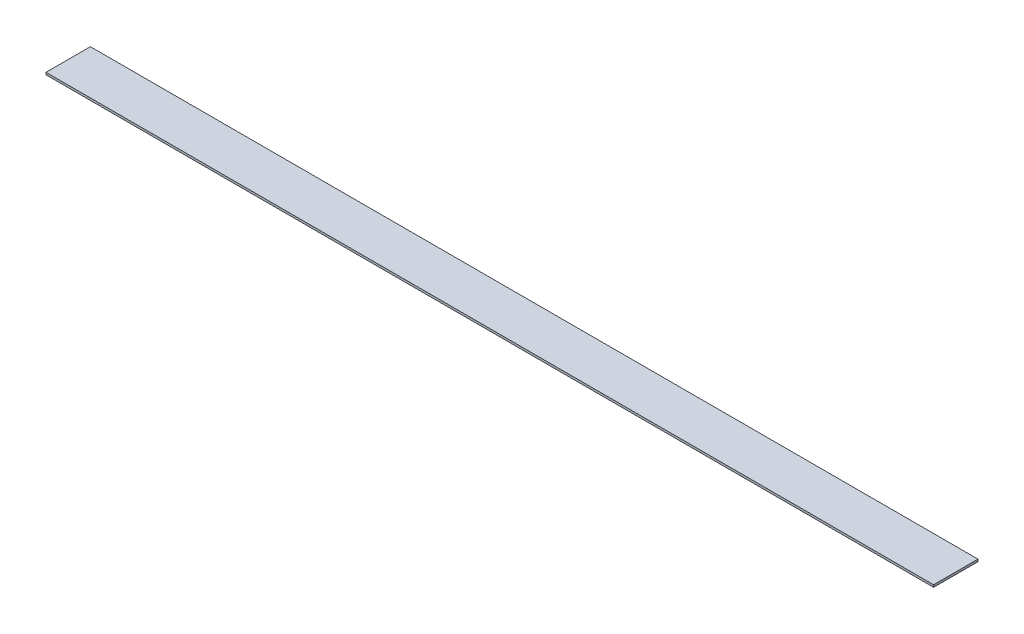
ISO-10303-21;
HEADER;
FILE_DESCRIPTION(('STEP AP214'),'2;1');
FILE_NAME('part.step','',(''),(''),'','','');
FILE_SCHEMA(('AUTOMOTIVE_DESIGN { 1 0 10303 214 1 1 1 1 }'));
ENDSEC;
DATA;
#1=APPLICATION_CONTEXT('core data for automotive mechanical design processes');
#2=APPLICATION_PROTOCOL_DEFINITION('international standard','automotive_design',2000,#1);
#3=PRODUCT_CONTEXT('',#1,'mechanical');
#4=PRODUCT('Part','Part','',(#3));
#5=PRODUCT_RELATED_PRODUCT_CATEGORY('part','',(#4));
#6=PRODUCT_DEFINITION_FORMATION('','',#4);
#7=PRODUCT_DEFINITION_CONTEXT('part definition',#1,'design');
#8=PRODUCT_DEFINITION('design','',#6,#7);
#9=PRODUCT_DEFINITION_SHAPE('','',#8);
#10=(LENGTH_UNIT() NAMED_UNIT(*) SI_UNIT(.MILLI.,.METRE.));
#11=(NAMED_UNIT(*) PLANE_ANGLE_UNIT() SI_UNIT($,.RADIAN.));
#12=(NAMED_UNIT(*) SI_UNIT($,.STERADIAN.) SOLID_ANGLE_UNIT());
#13=UNCERTAINTY_MEASURE_WITH_UNIT(LENGTH_MEASURE(1.E-05),#10,'distance_accuracy_value','');
#14=(GEOMETRIC_REPRESENTATION_CONTEXT(3) GLOBAL_UNCERTAINTY_ASSIGNED_CONTEXT((#13)) GLOBAL_UNIT_ASSIGNED_CONTEXT((#10,
#11,#12)) REPRESENTATION_CONTEXT('',''));
#15=CARTESIAN_POINT('',(0.,0.,0.));
#16=DIRECTION('',(0.,0.,1.));
#17=DIRECTION('',(1.,0.,0.));
#18=AXIS2_PLACEMENT_3D('',#15,#16,#17);
#19=CARTESIAN_POINT('',(20000.,100.,-1000.));
#20=DIRECTION('',(-1.,0.,0.));
#21=DIRECTION('',(0.,0.,1.));
#22=AXIS2_PLACEMENT_3D('',#19,#20,#21);
#23=PLANE('',#22);
#24=DIRECTION('',(0.,0.,-1.));
#25=VECTOR('',#24,1.);
#26=CARTESIAN_POINT('',(20000.,0.,-1000.));
#27=LINE('',#26,#25);
#28=CARTESIAN_POINT('',(20000.,0.,1000.));
#29=VERTEX_POINT('',#28);
#30=CARTESIAN_POINT('',(20000.,0.,-1000.));
#31=VERTEX_POINT('',#30);
#32=EDGE_CURVE('E101',#29,#31,#27,.T.);
#33=ORIENTED_EDGE('',*,*,#32,.T.);
#34=DIRECTION('',(0.,-1.,0.));
#35=VECTOR('',#34,1.);
#36=CARTESIAN_POINT('',(20000.,100.,-1000.));
#37=LINE('',#36,#35);
#38=CARTESIAN_POINT('',(20000.,100.,-1000.));
#39=VERTEX_POINT('',#38);
#40=EDGE_CURVE('E11',#39,#31,#37,.T.);
#41=ORIENTED_EDGE('',*,*,#40,.F.);
#42=DIRECTION('',(0.,0.,-1.));
#43=VECTOR('',#42,1.);
#44=CARTESIAN_POINT('',(20000.,100.,-1000.));
#45=LINE('',#44,#43);
#46=CARTESIAN_POINT('',(20000.,100.,1000.));
#47=VERTEX_POINT('',#46);
#48=EDGE_CURVE('E89',#47,#39,#45,.T.);
#49=ORIENTED_EDGE('',*,*,#48,.F.);
#50=DIRECTION('',(0.,-1.,0.));
#51=VECTOR('',#50,1.);
#52=CARTESIAN_POINT('',(20000.,100.,1000.));
#53=LINE('',#52,#51);
#54=EDGE_CURVE('E97',#47,#29,#53,.T.);
#55=ORIENTED_EDGE('',*,*,#54,.T.);
#56=EDGE_LOOP('',(#33,#41,#49,#55));
#57=FACE_BOUND('',#56,.T.);
#58=ADVANCED_FACE('F38',(#57),#23,.F.);
#59=CARTESIAN_POINT('',(-20000.,100.,-1000.));
#60=DIRECTION('',(0.,0.,1.));
#61=DIRECTION('',(1.,0.,0.));
#62=AXIS2_PLACEMENT_3D('',#59,#60,#61);
#63=PLANE('',#62);
#64=DIRECTION('',(-1.,0.,0.));
#65=VECTOR('',#64,1.);
#66=CARTESIAN_POINT('',(-20000.,0.,-1000.));
#67=LINE('',#66,#65);
#68=CARTESIAN_POINT('',(-20000.,0.,-1000.));
#69=VERTEX_POINT('',#68);
#70=EDGE_CURVE('E93',#31,#69,#67,.T.);
#71=ORIENTED_EDGE('',*,*,#70,.T.);
#72=DIRECTION('',(0.,-1.,0.));
#73=VECTOR('',#72,1.);
#74=CARTESIAN_POINT('',(-20000.,100.,-1000.));
#75=LINE('',#74,#73);
#76=CARTESIAN_POINT('',(-20000.,100.,-1000.));
#77=VERTEX_POINT('',#76);
#78=EDGE_CURVE('E46',#77,#69,#75,.T.);
#79=ORIENTED_EDGE('',*,*,#78,.F.);
#80=DIRECTION('',(-1.,0.,0.));
#81=VECTOR('',#80,1.);
#82=CARTESIAN_POINT('',(-20000.,100.,-1000.));
#83=LINE('',#82,#81);
#84=EDGE_CURVE('E84',#39,#77,#83,.T.);
#85=ORIENTED_EDGE('',*,*,#84,.F.);
#86=ORIENTED_EDGE('',*,*,#40,.T.);
#87=EDGE_LOOP('',(#71,#79,#85,#86));
#88=FACE_BOUND('',#87,.T.);
#89=ADVANCED_FACE('F92',(#88),#63,.F.);
#90=CARTESIAN_POINT('',(-20000.,100.,-1000.));
#91=DIRECTION('',(1.,0.,0.));
#92=DIRECTION('',(0.,0.,-1.));
#93=AXIS2_PLACEMENT_3D('',#90,#91,#92);
#94=PLANE('',#93);
#95=DIRECTION('',(0.,0.,1.));
#96=VECTOR('',#95,1.);
#97=CARTESIAN_POINT('',(-20000.,0.,-1000.));
#98=LINE('',#97,#96);
#99=CARTESIAN_POINT('',(-20000.,0.,1000.));
#100=VERTEX_POINT('',#99);
#101=EDGE_CURVE('E71',#69,#100,#98,.T.);
#102=ORIENTED_EDGE('',*,*,#101,.T.);
#103=DIRECTION('',(0.,-1.,0.));
#104=VECTOR('',#103,1.);
#105=CARTESIAN_POINT('',(-20000.,100.,1000.));
#106=LINE('',#105,#104);
#107=CARTESIAN_POINT('',(-20000.,100.,1000.));
#108=VERTEX_POINT('',#107);
#109=EDGE_CURVE('E94',#108,#100,#106,.T.);
#110=ORIENTED_EDGE('',*,*,#109,.F.);
#111=DIRECTION('',(0.,0.,1.));
#112=VECTOR('',#111,1.);
#113=CARTESIAN_POINT('',(-20000.,100.,-1000.));
#114=LINE('',#113,#112);
#115=EDGE_CURVE('E87',#77,#108,#114,.T.);
#116=ORIENTED_EDGE('',*,*,#115,.F.);
#117=ORIENTED_EDGE('',*,*,#78,.T.);
#118=EDGE_LOOP('',(#102,#110,#116,#117));
#119=FACE_BOUND('',#118,.T.);
#120=ADVANCED_FACE('F95',(#119),#94,.F.);
#121=CARTESIAN_POINT('',(-20000.,100.,1000.));
#122=DIRECTION('',(0.,0.,-1.));
#123=DIRECTION('',(-1.,0.,0.));
#124=AXIS2_PLACEMENT_3D('',#121,#122,#123);
#125=PLANE('',#124);
#126=DIRECTION('',(1.,0.,0.));
#127=VECTOR('',#126,1.);
#128=CARTESIAN_POINT('',(-20000.,0.,1000.));
#129=LINE('',#128,#127);
#130=EDGE_CURVE('E77',#100,#29,#129,.T.);
#131=ORIENTED_EDGE('',*,*,#130,.T.);
#132=ORIENTED_EDGE('',*,*,#54,.F.);
#133=DIRECTION('',(1.,0.,0.));
#134=VECTOR('',#133,1.);
#135=CARTESIAN_POINT('',(-20000.,100.,1000.));
#136=LINE('',#135,#134);
#137=EDGE_CURVE('E54',#108,#47,#136,.T.);
#138=ORIENTED_EDGE('',*,*,#137,.F.);
#139=ORIENTED_EDGE('',*,*,#109,.T.);
#140=EDGE_LOOP('',(#131,#132,#138,#139));
#141=FACE_BOUND('',#140,.T.);
#142=ADVANCED_FACE('F108',(#141),#125,.F.);
#143=CARTESIAN_POINT('',(0.,100.,0.));
#144=DIRECTION('',(0.,1.,0.));
#145=DIRECTION('',(0.,0.,1.));
#146=AXIS2_PLACEMENT_3D('',#143,#144,#145);
#147=PLANE('',#146);
#148=ORIENTED_EDGE('',*,*,#48,.T.);
#149=ORIENTED_EDGE('',*,*,#84,.T.);
#150=ORIENTED_EDGE('',*,*,#115,.T.);
#151=ORIENTED_EDGE('',*,*,#137,.T.);
#152=EDGE_LOOP('',(#148,#149,#150,#151));
#153=FACE_BOUND('',#152,.T.);
#154=ADVANCED_FACE('F85',(#153),#147,.T.);
#155=CARTESIAN_POINT('',(0.,0.,0.));
#156=DIRECTION('',(0.,1.,0.));
#157=DIRECTION('',(0.,0.,1.));
#158=AXIS2_PLACEMENT_3D('',#155,#156,#157);
#159=PLANE('',#158);
#160=ORIENTED_EDGE('',*,*,#32,.F.);
#161=ORIENTED_EDGE('',*,*,#130,.F.);
#162=ORIENTED_EDGE('',*,*,#101,.F.);
#163=ORIENTED_EDGE('',*,*,#70,.F.);
#164=EDGE_LOOP('',(#160,#161,#162,#163));
#165=FACE_BOUND('',#164,.T.);
#166=ADVANCED_FACE('F111',(#165),#159,.F.);
#167=CLOSED_SHELL('',(#58,#89,#120,#142,#154,#166));
#168=MANIFOLD_SOLID_BREP('B2',#167);
#169=ADVANCED_BREP_SHAPE_REPRESENTATION('',(#18,#168),#14);
#170=SHAPE_DEFINITION_REPRESENTATION(#9,#169);
ENDSEC;
END-ISO-10303-21;
